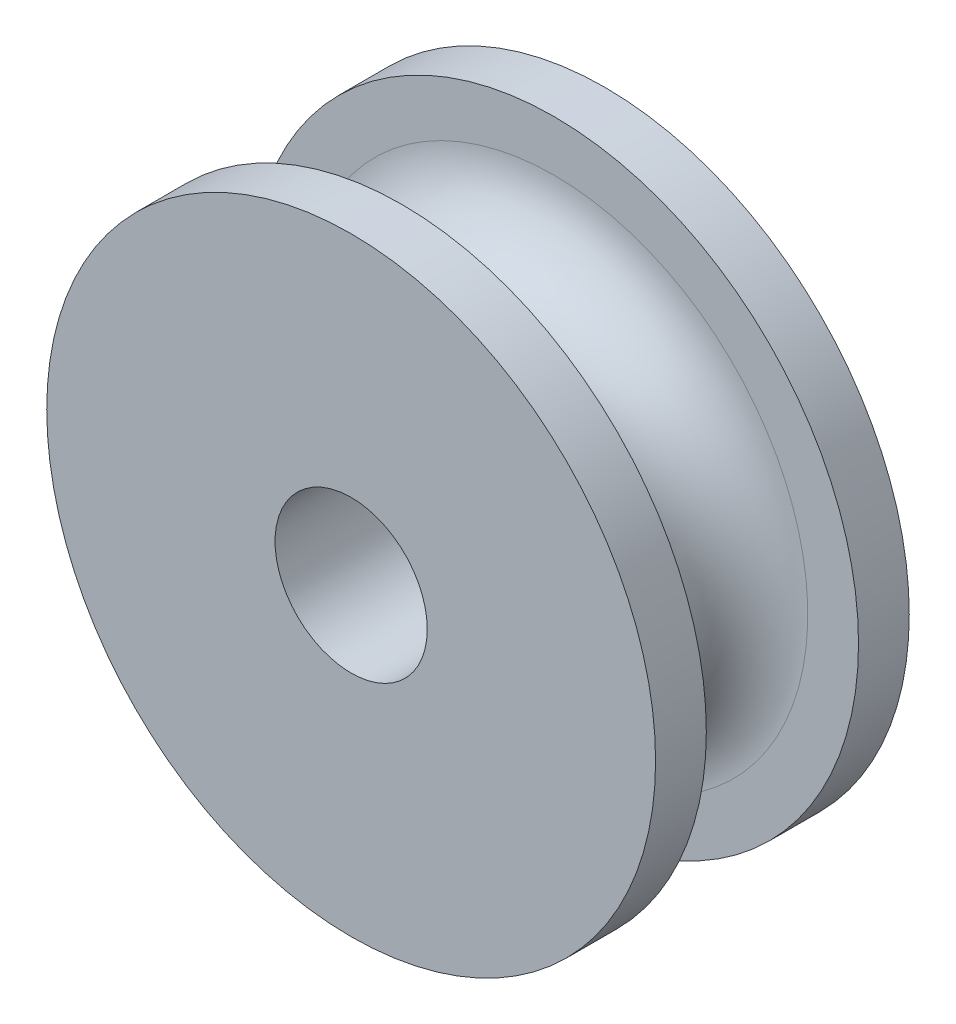
ISO-10303-21;
HEADER;
FILE_DESCRIPTION(('STEP AP214'),'2;1');
FILE_NAME('part.step','',(''),(''),'','','');
FILE_SCHEMA(('AUTOMOTIVE_DESIGN { 1 0 10303 214 1 1 1 1 }'));
ENDSEC;
DATA;
#1=APPLICATION_CONTEXT('core data for automotive mechanical design processes');
#2=APPLICATION_PROTOCOL_DEFINITION('international standard','automotive_design',2000,#1);
#3=PRODUCT_CONTEXT('',#1,'mechanical');
#4=PRODUCT('Part','Part','',(#3));
#5=PRODUCT_RELATED_PRODUCT_CATEGORY('part','',(#4));
#6=PRODUCT_DEFINITION_FORMATION('','',#4);
#7=PRODUCT_DEFINITION_CONTEXT('part definition',#1,'design');
#8=PRODUCT_DEFINITION('design','',#6,#7);
#9=PRODUCT_DEFINITION_SHAPE('','',#8);
#10=(LENGTH_UNIT() NAMED_UNIT(*) SI_UNIT(.MILLI.,.METRE.));
#11=(NAMED_UNIT(*) PLANE_ANGLE_UNIT() SI_UNIT($,.RADIAN.));
#12=(NAMED_UNIT(*) SI_UNIT($,.STERADIAN.) SOLID_ANGLE_UNIT());
#13=UNCERTAINTY_MEASURE_WITH_UNIT(LENGTH_MEASURE(1.E-05),#10,'distance_accuracy_value','');
#14=(GEOMETRIC_REPRESENTATION_CONTEXT(3) GLOBAL_UNCERTAINTY_ASSIGNED_CONTEXT((#13)) GLOBAL_UNIT_ASSIGNED_CONTEXT((#10,
#11,#12)) REPRESENTATION_CONTEXT('',''));
#15=CARTESIAN_POINT('',(0.,0.,0.));
#16=DIRECTION('',(0.,0.,1.));
#17=DIRECTION('',(1.,0.,0.));
#18=AXIS2_PLACEMENT_3D('',#15,#16,#17);
#19=CARTESIAN_POINT('',(368.894917120642,23.8157017452683,-270.556360518351));
#20=DIRECTION('',(0.,0.,-1.));
#21=DIRECTION('',(-1.,0.,0.));
#22=AXIS2_PLACEMENT_3D('',#19,#20,#21);
#23=PLANE('',#22);
#24=CARTESIAN_POINT('',(368.894917120642,29.3157017452683,-270.556360518351));
#25=DIRECTION('',(0.,0.,1.));
#26=DIRECTION('',(0.,-1.,0.));
#27=AXIS2_PLACEMENT_3D('',#24,#25,#26);
#28=CIRCLE('',#27,5.);
#29=CARTESIAN_POINT('',(368.894917120642,34.3157017452683,-270.556360518351));
#30=VERTEX_POINT('',#29);
#31=CARTESIAN_POINT('',(368.894917120642,24.3157017452683,-270.556360518351));
#32=VERTEX_POINT('',#31);
#33=EDGE_CURVE('E45',#30,#32,#28,.F.);
#34=ORIENTED_EDGE('',*,*,#33,.T.);
#35=CARTESIAN_POINT('',(368.894917120642,29.3157017452683,-270.556360518351));
#36=DIRECTION('',(0.,0.,1.));
#37=DIRECTION('',(0.,1.,0.));
#38=AXIS2_PLACEMENT_3D('',#35,#36,#37);
#39=CIRCLE('',#38,5.);
#40=EDGE_CURVE('E51',#32,#30,#39,.F.);
#41=ORIENTED_EDGE('',*,*,#40,.T.);
#42=EDGE_LOOP('',(#34,#41));
#43=FACE_BOUND('',#42,.T.);
#44=CARTESIAN_POINT('',(368.894917120642,29.3157017452683,-270.556360518351));
#45=DIRECTION('',(0.,0.,-1.));
#46=DIRECTION('',(-1.,0.,0.));
#47=AXIS2_PLACEMENT_3D('',#44,#45,#46);
#48=CIRCLE('',#47,6.);
#49=CARTESIAN_POINT('',(362.894917120642,29.3157017452683,-270.556360518351));
#50=VERTEX_POINT('',#49);
#51=EDGE_CURVE('E57',#50,#50,#48,.T.);
#52=ORIENTED_EDGE('',*,*,#51,.F.);
#53=EDGE_LOOP('',(#52));
#54=FACE_BOUND('',#53,.T.);
#55=ADVANCED_FACE('F17',(#43,#54),#23,.F.);
#56=CARTESIAN_POINT('',(368.894917120642,29.3157017452683,-269.056360518351));
#57=DIRECTION('',(0.,0.,1.));
#58=DIRECTION('',(0.,-1.,0.));
#59=AXIS2_PLACEMENT_3D('',#56,#57,#58);
#60=TOROIDAL_SURFACE('',#59,5.,1.5);
#61=CARTESIAN_POINT('',(368.894917120642,29.3157017452683,-267.556360518351));
#62=DIRECTION('',(0.,0.,-1.));
#63=DIRECTION('',(0.,-1.,0.));
#64=AXIS2_PLACEMENT_3D('',#61,#62,#63);
#65=CIRCLE('',#64,5.00000000000001);
#66=CARTESIAN_POINT('',(368.894917120642,24.3157017452683,-267.556360518351));
#67=VERTEX_POINT('',#66);
#68=CARTESIAN_POINT('',(368.894917120642,34.3157017452683,-267.556360518351));
#69=VERTEX_POINT('',#68);
#70=EDGE_CURVE('E36',#67,#69,#65,.T.);
#71=ORIENTED_EDGE('',*,*,#70,.T.);
#72=CARTESIAN_POINT('',(368.894917120642,29.3157017452683,-267.556360518351));
#73=DIRECTION('',(0.,0.,-1.));
#74=DIRECTION('',(0.,1.,0.));
#75=AXIS2_PLACEMENT_3D('',#72,#73,#74);
#76=CIRCLE('',#75,5.);
#77=EDGE_CURVE('E100',#69,#67,#76,.T.);
#78=ORIENTED_EDGE('',*,*,#77,.T.);
#79=EDGE_LOOP('',(#71,#78));
#80=FACE_BOUND('',#79,.T.);
#81=ORIENTED_EDGE('',*,*,#40,.F.);
#82=ORIENTED_EDGE('',*,*,#33,.F.);
#83=EDGE_LOOP('',(#81,#82));
#84=FACE_BOUND('',#83,.T.);
#85=ADVANCED_FACE('F50',(#80,#84),#60,.F.);
#86=CARTESIAN_POINT('',(368.894917120642,29.3157017452683,-271.056360518351));
#87=DIRECTION('',(0.,0.,-1.));
#88=DIRECTION('',(-1.,0.,0.));
#89=AXIS2_PLACEMENT_3D('',#86,#87,#88);
#90=CYLINDRICAL_SURFACE('',#89,6.);
#91=ORIENTED_EDGE('',*,*,#51,.T.);
#92=EDGE_LOOP('',(#91));
#93=FACE_BOUND('',#92,.T.);
#94=CARTESIAN_POINT('',(368.894917120642,29.3157017452683,-271.556360518351));
#95=DIRECTION('',(0.,0.,-1.));
#96=DIRECTION('',(-1.,0.,0.));
#97=AXIS2_PLACEMENT_3D('',#94,#95,#96);
#98=CIRCLE('',#97,6.);
#99=CARTESIAN_POINT('',(362.894917120642,29.3157017452683,-271.556360518351));
#100=VERTEX_POINT('',#99);
#101=EDGE_CURVE('E101',#100,#100,#98,.F.);
#102=ORIENTED_EDGE('',*,*,#101,.T.);
#103=EDGE_LOOP('',(#102));
#104=FACE_BOUND('',#103,.T.);
#105=ADVANCED_FACE('F82',(#93,#104),#90,.T.);
#106=CARTESIAN_POINT('',(368.894917120642,23.8157017452683,-267.556360518351));
#107=DIRECTION('',(0.,0.,1.));
#108=DIRECTION('',(1.,0.,0.));
#109=AXIS2_PLACEMENT_3D('',#106,#107,#108);
#110=PLANE('',#109);
#111=CARTESIAN_POINT('',(368.894917120642,29.3157017452683,-267.556360518351));
#112=DIRECTION('',(0.,0.,-1.));
#113=DIRECTION('',(-1.,0.,0.));
#114=AXIS2_PLACEMENT_3D('',#111,#112,#113);
#115=CIRCLE('',#114,6.);
#116=CARTESIAN_POINT('',(362.894917120642,29.3157017452683,-267.556360518351));
#117=VERTEX_POINT('',#116);
#118=EDGE_CURVE('E103',#117,#117,#115,.F.);
#119=ORIENTED_EDGE('',*,*,#118,.F.);
#120=EDGE_LOOP('',(#119));
#121=FACE_BOUND('',#120,.T.);
#122=ORIENTED_EDGE('',*,*,#77,.F.);
#123=ORIENTED_EDGE('',*,*,#70,.F.);
#124=EDGE_LOOP('',(#122,#123));
#125=FACE_BOUND('',#124,.T.);
#126=ADVANCED_FACE('F136',(#121,#125),#110,.F.);
#127=CARTESIAN_POINT('',(368.894917120642,25.5657017452683,-271.556360518351));
#128=DIRECTION('',(0.,0.,1.));
#129=DIRECTION('',(1.,0.,0.));
#130=AXIS2_PLACEMENT_3D('',#127,#128,#129);
#131=PLANE('',#130);
#132=ORIENTED_EDGE('',*,*,#101,.F.);
#133=EDGE_LOOP('',(#132));
#134=FACE_BOUND('',#133,.T.);
#135=CARTESIAN_POINT('',(368.894917120642,29.3157017452683,-271.556360518351));
#136=DIRECTION('',(0.,0.,1.));
#137=DIRECTION('',(1.,0.,0.));
#138=AXIS2_PLACEMENT_3D('',#135,#136,#137);
#139=CIRCLE('',#138,1.5);
#140=CARTESIAN_POINT('',(370.394917120642,29.3157017452683,-271.556360518351));
#141=VERTEX_POINT('',#140);
#142=EDGE_CURVE('E111',#141,#141,#139,.T.);
#143=ORIENTED_EDGE('',*,*,#142,.T.);
#144=EDGE_LOOP('',(#143));
#145=FACE_BOUND('',#144,.T.);
#146=ADVANCED_FACE('F134',(#134,#145),#131,.F.);
#147=CARTESIAN_POINT('',(368.894917120642,29.3157017452683,-267.056360518351));
#148=DIRECTION('',(0.,0.,-1.));
#149=DIRECTION('',(-1.,0.,0.));
#150=AXIS2_PLACEMENT_3D('',#147,#148,#149);
#151=CYLINDRICAL_SURFACE('',#150,6.);
#152=CARTESIAN_POINT('',(368.894917120642,29.3157017452683,-266.556360518351));
#153=DIRECTION('',(0.,0.,-1.));
#154=DIRECTION('',(-1.,0.,0.));
#155=AXIS2_PLACEMENT_3D('',#152,#153,#154);
#156=CIRCLE('',#155,6.);
#157=CARTESIAN_POINT('',(362.894917120642,29.3157017452683,-266.556360518351));
#158=VERTEX_POINT('',#157);
#159=EDGE_CURVE('E28',#158,#158,#156,.T.);
#160=ORIENTED_EDGE('',*,*,#159,.T.);
#161=EDGE_LOOP('',(#160));
#162=FACE_BOUND('',#161,.T.);
#163=ORIENTED_EDGE('',*,*,#118,.T.);
#164=EDGE_LOOP('',(#163));
#165=FACE_BOUND('',#164,.T.);
#166=ADVANCED_FACE('F116',(#162,#165),#151,.T.);
#167=CARTESIAN_POINT('',(368.894917120642,29.3157017452683,-269.056360518351));
#168=DIRECTION('',(0.,0.,1.));
#169=DIRECTION('',(1.,0.,0.));
#170=AXIS2_PLACEMENT_3D('',#167,#168,#169);
#171=CYLINDRICAL_SURFACE('',#170,1.5);
#172=ORIENTED_EDGE('',*,*,#142,.F.);
#173=EDGE_LOOP('',(#172));
#174=FACE_BOUND('',#173,.T.);
#175=CARTESIAN_POINT('',(368.894917120642,29.3157017452683,-266.556360518351));
#176=DIRECTION('',(0.,0.,1.));
#177=DIRECTION('',(1.,0.,0.));
#178=AXIS2_PLACEMENT_3D('',#175,#176,#177);
#179=CIRCLE('',#178,1.5);
#180=CARTESIAN_POINT('',(370.394917120642,29.3157017452683,-266.556360518351));
#181=VERTEX_POINT('',#180);
#182=EDGE_CURVE('E11',#181,#181,#179,.T.);
#183=ORIENTED_EDGE('',*,*,#182,.T.);
#184=EDGE_LOOP('',(#183));
#185=FACE_BOUND('',#184,.T.);
#186=ADVANCED_FACE('F121',(#174,#185),#171,.F.);
#187=CARTESIAN_POINT('',(368.894917120642,25.5657017452683,-266.556360518351));
#188=DIRECTION('',(0.,0.,-1.));
#189=DIRECTION('',(-1.,0.,0.));
#190=AXIS2_PLACEMENT_3D('',#187,#188,#189);
#191=PLANE('',#190);
#192=ORIENTED_EDGE('',*,*,#182,.F.);
#193=EDGE_LOOP('',(#192));
#194=FACE_BOUND('',#193,.T.);
#195=ORIENTED_EDGE('',*,*,#159,.F.);
#196=EDGE_LOOP('',(#195));
#197=FACE_BOUND('',#196,.T.);
#198=ADVANCED_FACE('F119',(#194,#197),#191,.F.);
#199=CLOSED_SHELL('',(#55,#85,#105,#126,#146,#166,#186,#198));
#200=MANIFOLD_SOLID_BREP('B1',#199);
#201=ADVANCED_BREP_SHAPE_REPRESENTATION('',(#18,#200),#14);
#202=SHAPE_DEFINITION_REPRESENTATION(#9,#201);
ENDSEC;
END-ISO-10303-21;
